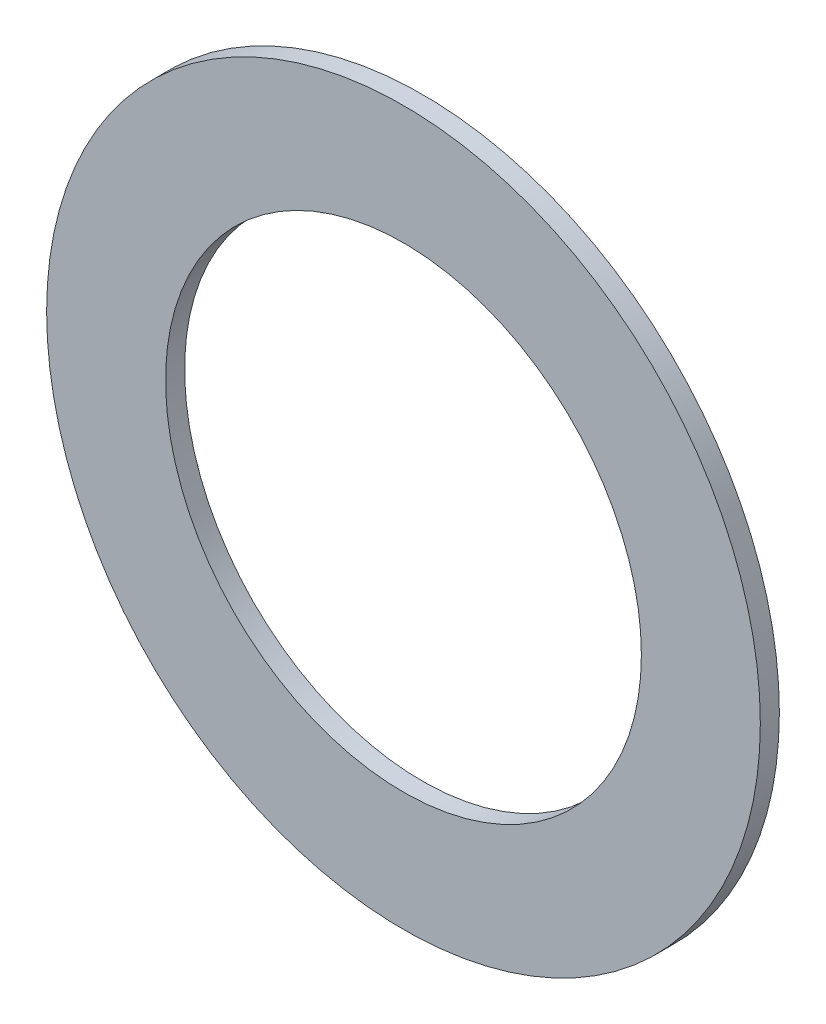
ISO-10303-21;
HEADER;
FILE_DESCRIPTION(('STEP AP214'),'2;1');
FILE_NAME('part.step','',(''),(''),'','','');
FILE_SCHEMA(('AUTOMOTIVE_DESIGN { 1 0 10303 214 1 1 1 1 }'));
ENDSEC;
DATA;
#1=APPLICATION_CONTEXT('core data for automotive mechanical design processes');
#2=APPLICATION_PROTOCOL_DEFINITION('international standard','automotive_design',2000,#1);
#3=PRODUCT_CONTEXT('',#1,'mechanical');
#4=PRODUCT('Part','Part','',(#3));
#5=PRODUCT_RELATED_PRODUCT_CATEGORY('part','',(#4));
#6=PRODUCT_DEFINITION_FORMATION('','',#4);
#7=PRODUCT_DEFINITION_CONTEXT('part definition',#1,'design');
#8=PRODUCT_DEFINITION('design','',#6,#7);
#9=PRODUCT_DEFINITION_SHAPE('','',#8);
#10=(LENGTH_UNIT() NAMED_UNIT(*) SI_UNIT(.MILLI.,.METRE.));
#11=(NAMED_UNIT(*) PLANE_ANGLE_UNIT() SI_UNIT($,.RADIAN.));
#12=(NAMED_UNIT(*) SI_UNIT($,.STERADIAN.) SOLID_ANGLE_UNIT());
#13=UNCERTAINTY_MEASURE_WITH_UNIT(LENGTH_MEASURE(1.E-05),#10,'distance_accuracy_value','');
#14=(GEOMETRIC_REPRESENTATION_CONTEXT(3) GLOBAL_UNCERTAINTY_ASSIGNED_CONTEXT((#13)) GLOBAL_UNIT_ASSIGNED_CONTEXT((#10,
#11,#12)) REPRESENTATION_CONTEXT('',''));
#15=CARTESIAN_POINT('',(0.,0.,0.));
#16=DIRECTION('',(0.,0.,1.));
#17=DIRECTION('',(1.,0.,0.));
#18=AXIS2_PLACEMENT_3D('',#15,#16,#17);
#19=CARTESIAN_POINT('',(0.,0.,-0.254));
#20=DIRECTION('',(0.,0.,-1.));
#21=DIRECTION('',(1.,0.,0.));
#22=AXIS2_PLACEMENT_3D('',#19,#20,#21);
#23=PLANE('',#22);
#24=CARTESIAN_POINT('',(0.,0.,-0.254));
#25=DIRECTION('',(0.,0.,1.));
#26=DIRECTION('',(1.,0.,0.));
#27=AXIS2_PLACEMENT_3D('',#24,#25,#26);
#28=CIRCLE('',#27,4.7625);
#29=CARTESIAN_POINT('',(4.7625,0.,-0.254));
#30=VERTEX_POINT('',#29);
#31=EDGE_CURVE('E10',#30,#30,#28,.T.);
#32=ORIENTED_EDGE('',*,*,#31,.F.);
#33=EDGE_LOOP('',(#32));
#34=FACE_BOUND('',#33,.T.);
#35=CARTESIAN_POINT('',(0.,0.,-0.254));
#36=DIRECTION('',(0.,0.,1.));
#37=DIRECTION('',(1.,0.,0.));
#38=AXIS2_PLACEMENT_3D('',#35,#36,#37);
#39=CIRCLE('',#38,3.175);
#40=CARTESIAN_POINT('',(3.175,0.,-0.254));
#41=VERTEX_POINT('',#40);
#42=EDGE_CURVE('E41',#41,#41,#39,.T.);
#43=ORIENTED_EDGE('',*,*,#42,.T.);
#44=EDGE_LOOP('',(#43));
#45=FACE_BOUND('',#44,.T.);
#46=ADVANCED_FACE('F30',(#34,#45),#23,.T.);
#47=CARTESIAN_POINT('',(0.,0.,0.));
#48=DIRECTION('',(0.,0.,-1.));
#49=DIRECTION('',(1.,0.,0.));
#50=AXIS2_PLACEMENT_3D('',#47,#48,#49);
#51=PLANE('',#50);
#52=CARTESIAN_POINT('',(0.,0.,0.));
#53=DIRECTION('',(0.,0.,1.));
#54=DIRECTION('',(1.,0.,0.));
#55=AXIS2_PLACEMENT_3D('',#52,#53,#54);
#56=CIRCLE('',#55,4.7625);
#57=CARTESIAN_POINT('',(4.7625,0.,0.));
#58=VERTEX_POINT('',#57);
#59=EDGE_CURVE('E34',#58,#58,#56,.T.);
#60=ORIENTED_EDGE('',*,*,#59,.T.);
#61=EDGE_LOOP('',(#60));
#62=FACE_BOUND('',#61,.T.);
#63=CARTESIAN_POINT('',(0.,0.,0.));
#64=DIRECTION('',(0.,0.,1.));
#65=DIRECTION('',(1.,0.,0.));
#66=AXIS2_PLACEMENT_3D('',#63,#64,#65);
#67=CIRCLE('',#66,3.175);
#68=CARTESIAN_POINT('',(3.175,0.,0.));
#69=VERTEX_POINT('',#68);
#70=EDGE_CURVE('E43',#69,#69,#67,.T.);
#71=ORIENTED_EDGE('',*,*,#70,.F.);
#72=EDGE_LOOP('',(#71));
#73=FACE_BOUND('',#72,.T.);
#74=ADVANCED_FACE('F56',(#62,#73),#51,.F.);
#75=CARTESIAN_POINT('',(0.,0.,-0.254));
#76=DIRECTION('',(0.,0.,1.));
#77=DIRECTION('',(-1.,0.,0.));
#78=AXIS2_PLACEMENT_3D('',#75,#76,#77);
#79=CYLINDRICAL_SURFACE('',#78,4.7625);
#80=ORIENTED_EDGE('',*,*,#31,.T.);
#81=EDGE_LOOP('',(#80));
#82=FACE_BOUND('',#81,.T.);
#83=ORIENTED_EDGE('',*,*,#59,.F.);
#84=EDGE_LOOP('',(#83));
#85=FACE_BOUND('',#84,.T.);
#86=ADVANCED_FACE('F32',(#82,#85),#79,.T.);
#87=CARTESIAN_POINT('',(0.,0.,-0.254));
#88=DIRECTION('',(0.,0.,1.));
#89=DIRECTION('',(-1.,0.,0.));
#90=AXIS2_PLACEMENT_3D('',#87,#88,#89);
#91=CYLINDRICAL_SURFACE('',#90,3.175);
#92=ORIENTED_EDGE('',*,*,#42,.F.);
#93=EDGE_LOOP('',(#92));
#94=FACE_BOUND('',#93,.T.);
#95=ORIENTED_EDGE('',*,*,#70,.T.);
#96=EDGE_LOOP('',(#95));
#97=FACE_BOUND('',#96,.T.);
#98=ADVANCED_FACE('F50',(#94,#97),#91,.F.);
#99=CLOSED_SHELL('',(#46,#74,#86,#98));
#100=MANIFOLD_SOLID_BREP('B2',#99);
#101=ADVANCED_BREP_SHAPE_REPRESENTATION('',(#18,#100),#14);
#102=SHAPE_DEFINITION_REPRESENTATION(#9,#101);
ENDSEC;
END-ISO-10303-21;
